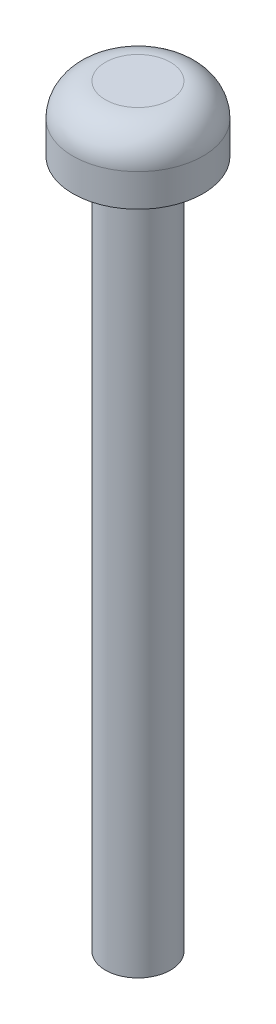
ISO-10303-21;
HEADER;
FILE_DESCRIPTION(('STEP AP214'),'2;1');
FILE_NAME('part.step','',(''),(''),'','','');
FILE_SCHEMA(('AUTOMOTIVE_DESIGN { 1 0 10303 214 1 1 1 1 }'));
ENDSEC;
DATA;
#1=APPLICATION_CONTEXT('core data for automotive mechanical design processes');
#2=APPLICATION_PROTOCOL_DEFINITION('international standard','automotive_design',2000,#1);
#3=PRODUCT_CONTEXT('',#1,'mechanical');
#4=PRODUCT('Part','Part','',(#3));
#5=PRODUCT_RELATED_PRODUCT_CATEGORY('part','',(#4));
#6=PRODUCT_DEFINITION_FORMATION('','',#4);
#7=PRODUCT_DEFINITION_CONTEXT('part definition',#1,'design');
#8=PRODUCT_DEFINITION('design','',#6,#7);
#9=PRODUCT_DEFINITION_SHAPE('','',#8);
#10=(LENGTH_UNIT() NAMED_UNIT(*) SI_UNIT(.MILLI.,.METRE.));
#11=(NAMED_UNIT(*) PLANE_ANGLE_UNIT() SI_UNIT($,.RADIAN.));
#12=(NAMED_UNIT(*) SI_UNIT($,.STERADIAN.) SOLID_ANGLE_UNIT());
#13=UNCERTAINTY_MEASURE_WITH_UNIT(LENGTH_MEASURE(1.E-05),#10,'distance_accuracy_value','');
#14=(GEOMETRIC_REPRESENTATION_CONTEXT(3) GLOBAL_UNCERTAINTY_ASSIGNED_CONTEXT((#13)) GLOBAL_UNIT_ASSIGNED_CONTEXT((#10,
#11,#12)) REPRESENTATION_CONTEXT('',''));
#15=CARTESIAN_POINT('',(0.,0.,0.));
#16=DIRECTION('',(0.,0.,1.));
#17=DIRECTION('',(1.,0.,0.));
#18=AXIS2_PLACEMENT_3D('',#15,#16,#17);
#19=CARTESIAN_POINT('',(0.,3.,0.));
#20=DIRECTION('',(0.,-1.,0.));
#21=DIRECTION('',(0.,0.,-1.));
#22=AXIS2_PLACEMENT_3D('',#19,#20,#21);
#23=CYLINDRICAL_SURFACE('',#22,3.);
#24=CARTESIAN_POINT('',(0.,1.5,0.));
#25=DIRECTION('',(0.,1.,0.));
#26=DIRECTION('',(0.,0.,1.));
#27=AXIS2_PLACEMENT_3D('',#24,#25,#26);
#28=CIRCLE('',#27,3.);
#29=CARTESIAN_POINT('',(0.,1.5,3.));
#30=VERTEX_POINT('',#29);
#31=EDGE_CURVE('E36',#30,#30,#28,.F.);
#32=ORIENTED_EDGE('',*,*,#31,.T.);
#33=EDGE_LOOP('',(#32));
#34=FACE_BOUND('',#33,.T.);
#35=CARTESIAN_POINT('',(0.,0.,0.));
#36=DIRECTION('',(0.,1.,0.));
#37=DIRECTION('',(0.,0.,1.));
#38=AXIS2_PLACEMENT_3D('',#35,#36,#37);
#39=CIRCLE('',#38,3.);
#40=CARTESIAN_POINT('',(0.,0.,3.));
#41=VERTEX_POINT('',#40);
#42=EDGE_CURVE('E48',#41,#41,#39,.T.);
#43=ORIENTED_EDGE('',*,*,#42,.T.);
#44=EDGE_LOOP('',(#43));
#45=FACE_BOUND('',#44,.T.);
#46=ADVANCED_FACE('F32',(#34,#45),#23,.T.);
#47=CARTESIAN_POINT('',(0.,3.,0.));
#48=DIRECTION('',(0.,1.,0.));
#49=DIRECTION('',(0.,0.,1.));
#50=AXIS2_PLACEMENT_3D('',#47,#48,#49);
#51=PLANE('',#50);
#52=CARTESIAN_POINT('',(0.,3.,0.));
#53=DIRECTION('',(0.,1.,0.));
#54=DIRECTION('',(0.,0.,1.));
#55=AXIS2_PLACEMENT_3D('',#52,#53,#54);
#56=CIRCLE('',#55,1.5);
#57=CARTESIAN_POINT('',(0.,3.,1.5));
#58=VERTEX_POINT('',#57);
#59=EDGE_CURVE('E44',#58,#58,#56,.T.);
#60=ORIENTED_EDGE('',*,*,#59,.T.);
#61=EDGE_LOOP('',(#60));
#62=FACE_BOUND('',#61,.T.);
#63=ADVANCED_FACE('F53',(#62),#51,.T.);
#64=CARTESIAN_POINT('',(0.,0.,0.));
#65=DIRECTION('',(0.,1.,0.));
#66=DIRECTION('',(0.,0.,1.));
#67=AXIS2_PLACEMENT_3D('',#64,#65,#66);
#68=PLANE('',#67);
#69=CARTESIAN_POINT('',(0.,0.,0.));
#70=DIRECTION('',(0.,-1.,0.));
#71=DIRECTION('',(0.,0.,-1.));
#72=AXIS2_PLACEMENT_3D('',#69,#70,#71);
#73=CIRCLE('',#72,1.5);
#74=CARTESIAN_POINT('',(0.,0.,-1.5));
#75=VERTEX_POINT('',#74);
#76=EDGE_CURVE('E10',#75,#75,#73,.T.);
#77=ORIENTED_EDGE('',*,*,#76,.F.);
#78=EDGE_LOOP('',(#77));
#79=FACE_BOUND('',#78,.T.);
#80=ORIENTED_EDGE('',*,*,#42,.F.);
#81=EDGE_LOOP('',(#80));
#82=FACE_BOUND('',#81,.T.);
#83=ADVANCED_FACE('F57',(#79,#82),#68,.F.);
#84=CARTESIAN_POINT('',(0.,1.5,0.));
#85=DIRECTION('',(0.,1.,0.));
#86=DIRECTION('',(0.,0.,1.));
#87=AXIS2_PLACEMENT_3D('',#84,#85,#86);
#88=DEGENERATE_TOROIDAL_SURFACE('',#87,1.5,1.5,.T.);
#89=ORIENTED_EDGE('',*,*,#31,.F.);
#90=EDGE_LOOP('',(#89));
#91=FACE_BOUND('',#90,.T.);
#92=ORIENTED_EDGE('',*,*,#59,.F.);
#93=EDGE_LOOP('',(#92));
#94=FACE_BOUND('',#93,.T.);
#95=ADVANCED_FACE('F34',(#91,#94),#88,.T.);
#96=CARTESIAN_POINT('',(0.,-31.75,0.));
#97=DIRECTION('',(0.,1.,0.));
#98=DIRECTION('',(0.,0.,1.));
#99=AXIS2_PLACEMENT_3D('',#96,#97,#98);
#100=CYLINDRICAL_SURFACE('',#99,1.5);
#101=CARTESIAN_POINT('',(0.,-31.75,0.));
#102=DIRECTION('',(0.,-1.,0.));
#103=DIRECTION('',(0.,0.,-1.));
#104=AXIS2_PLACEMENT_3D('',#101,#102,#103);
#105=CIRCLE('',#104,1.5);
#106=CARTESIAN_POINT('',(0.,-31.75,-1.5));
#107=VERTEX_POINT('',#106);
#108=EDGE_CURVE('E47',#107,#107,#105,.T.);
#109=ORIENTED_EDGE('',*,*,#108,.F.);
#110=EDGE_LOOP('',(#109));
#111=FACE_BOUND('',#110,.T.);
#112=ORIENTED_EDGE('',*,*,#76,.T.);
#113=EDGE_LOOP('',(#112));
#114=FACE_BOUND('',#113,.T.);
#115=ADVANCED_FACE('F56',(#111,#114),#100,.T.);
#116=CARTESIAN_POINT('',(0.,-31.75,0.));
#117=DIRECTION('',(0.,-1.,0.));
#118=DIRECTION('',(0.,0.,-1.));
#119=AXIS2_PLACEMENT_3D('',#116,#117,#118);
#120=PLANE('',#119);
#121=ORIENTED_EDGE('',*,*,#108,.T.);
#122=EDGE_LOOP('',(#121));
#123=FACE_BOUND('',#122,.T.);
#124=ADVANCED_FACE('F63',(#123),#120,.T.);
#125=CLOSED_SHELL('',(#46,#63,#83,#95,#115,#124));
#126=MANIFOLD_SOLID_BREP('B2',#125);
#127=ADVANCED_BREP_SHAPE_REPRESENTATION('',(#18,#126),#14);
#128=SHAPE_DEFINITION_REPRESENTATION(#9,#127);
ENDSEC;
END-ISO-10303-21;
